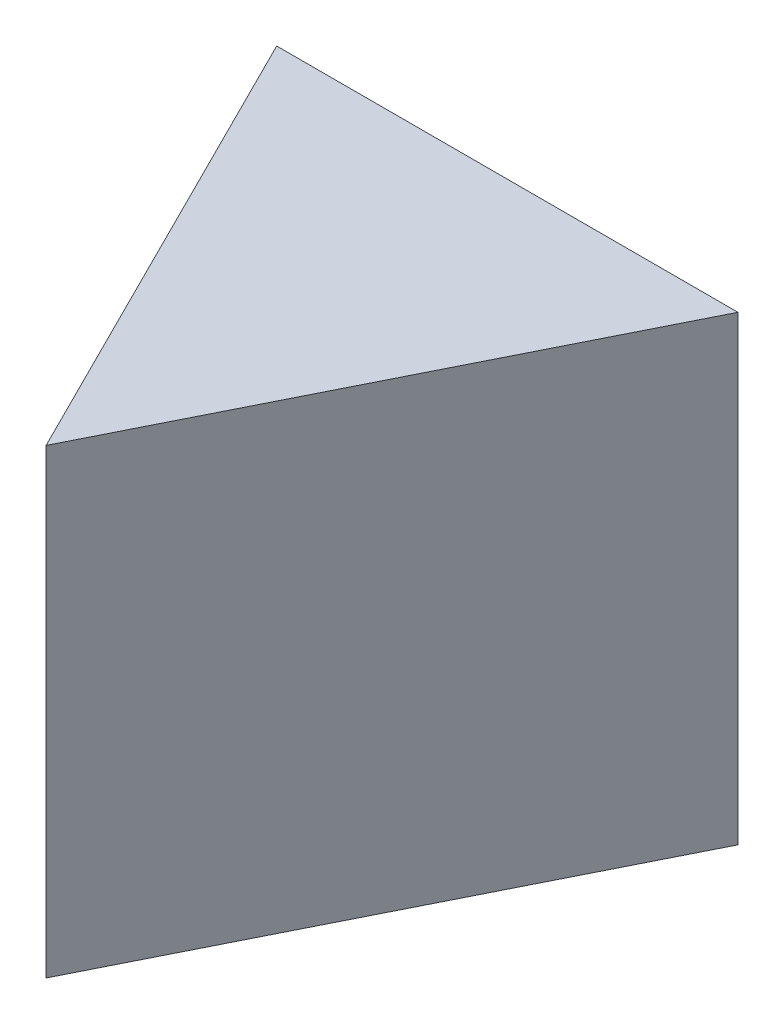
ISO-10303-21;
HEADER;
FILE_DESCRIPTION(('STEP AP214'),'2;1');
FILE_NAME('part.step','',(''),(''),'','','');
FILE_SCHEMA(('AUTOMOTIVE_DESIGN { 1 0 10303 214 1 1 1 1 }'));
ENDSEC;
DATA;
#1=APPLICATION_CONTEXT('core data for automotive mechanical design processes');
#2=APPLICATION_PROTOCOL_DEFINITION('international standard','automotive_design',2000,#1);
#3=PRODUCT_CONTEXT('',#1,'mechanical');
#4=PRODUCT('Part','Part','',(#3));
#5=PRODUCT_RELATED_PRODUCT_CATEGORY('part','',(#4));
#6=PRODUCT_DEFINITION_FORMATION('','',#4);
#7=PRODUCT_DEFINITION_CONTEXT('part definition',#1,'design');
#8=PRODUCT_DEFINITION('design','',#6,#7);
#9=PRODUCT_DEFINITION_SHAPE('','',#8);
#10=(LENGTH_UNIT() NAMED_UNIT(*) SI_UNIT(.MILLI.,.METRE.));
#11=(NAMED_UNIT(*) PLANE_ANGLE_UNIT() SI_UNIT($,.RADIAN.));
#12=(NAMED_UNIT(*) SI_UNIT($,.STERADIAN.) SOLID_ANGLE_UNIT());
#13=UNCERTAINTY_MEASURE_WITH_UNIT(LENGTH_MEASURE(1.E-05),#10,'distance_accuracy_value','');
#14=(GEOMETRIC_REPRESENTATION_CONTEXT(3) GLOBAL_UNCERTAINTY_ASSIGNED_CONTEXT((#13)) GLOBAL_UNIT_ASSIGNED_CONTEXT((#10,
#11,#12)) REPRESENTATION_CONTEXT('',''));
#15=CARTESIAN_POINT('',(0.,0.,0.));
#16=DIRECTION('',(0.,0.,1.));
#17=DIRECTION('',(1.,0.,0.));
#18=AXIS2_PLACEMENT_3D('',#15,#16,#17);
#19=CARTESIAN_POINT('',(0.,0.,20.));
#20=DIRECTION('',(0.,1.,0.));
#21=DIRECTION('',(0.,0.,1.));
#22=AXIS2_PLACEMENT_3D('',#19,#20,#21);
#23=PLANE('',#22);
#24=DIRECTION('',(1.,0.,0.));
#25=VECTOR('',#24,1.);
#26=CARTESIAN_POINT('',(0.,0.,0.));
#27=LINE('',#26,#25);
#28=CARTESIAN_POINT('',(0.,0.,0.));
#29=VERTEX_POINT('',#28);
#30=CARTESIAN_POINT('',(20.,0.,0.));
#31=VERTEX_POINT('',#30);
#32=EDGE_CURVE('E76',#29,#31,#27,.T.);
#33=ORIENTED_EDGE('',*,*,#32,.T.);
#34=DIRECTION('',(-0.447213595499958,0.,0.894427190999916));
#35=VECTOR('',#34,1.);
#36=CARTESIAN_POINT('',(20.,0.,0.));
#37=LINE('',#36,#35);
#38=CARTESIAN_POINT('',(10.,0.,20.));
#39=VERTEX_POINT('',#38);
#40=EDGE_CURVE('E66',#31,#39,#37,.T.);
#41=ORIENTED_EDGE('',*,*,#40,.T.);
#42=DIRECTION('',(-0.447213595499958,0.,-0.894427190999916));
#43=VECTOR('',#42,1.);
#44=CARTESIAN_POINT('',(0.,0.,0.));
#45=LINE('',#44,#43);
#46=EDGE_CURVE('E77',#39,#29,#45,.T.);
#47=ORIENTED_EDGE('',*,*,#46,.T.);
#48=EDGE_LOOP('',(#33,#41,#47));
#49=FACE_BOUND('',#48,.T.);
#50=ADVANCED_FACE('F33',(#49),#23,.F.);
#51=CARTESIAN_POINT('',(0.,20.,20.));
#52=DIRECTION('',(0.,-1.,0.));
#53=DIRECTION('',(0.,0.,-1.));
#54=AXIS2_PLACEMENT_3D('',#51,#52,#53);
#55=PLANE('',#54);
#56=DIRECTION('',(-0.447213595499958,0.,-0.894427190999916));
#57=VECTOR('',#56,1.);
#58=CARTESIAN_POINT('',(0.,20.,0.));
#59=LINE('',#58,#57);
#60=CARTESIAN_POINT('',(10.,20.,20.));
#61=VERTEX_POINT('',#60);
#62=CARTESIAN_POINT('',(0.,20.,0.));
#63=VERTEX_POINT('',#62);
#64=EDGE_CURVE('E47',#61,#63,#59,.T.);
#65=ORIENTED_EDGE('',*,*,#64,.F.);
#66=DIRECTION('',(-0.447213595499958,0.,0.894427190999916));
#67=VECTOR('',#66,1.);
#68=CARTESIAN_POINT('',(20.,20.,0.));
#69=LINE('',#68,#67);
#70=CARTESIAN_POINT('',(20.,20.,0.));
#71=VERTEX_POINT('',#70);
#72=EDGE_CURVE('E73',#71,#61,#69,.T.);
#73=ORIENTED_EDGE('',*,*,#72,.F.);
#74=DIRECTION('',(-1.,0.,0.));
#75=VECTOR('',#74,1.);
#76=CARTESIAN_POINT('',(0.,20.,0.));
#77=LINE('',#76,#75);
#78=EDGE_CURVE('E11',#71,#63,#77,.T.);
#79=ORIENTED_EDGE('',*,*,#78,.T.);
#80=EDGE_LOOP('',(#65,#73,#79));
#81=FACE_BOUND('',#80,.T.);
#82=ADVANCED_FACE('F89',(#81),#55,.F.);
#83=CARTESIAN_POINT('',(0.,0.,0.));
#84=DIRECTION('',(0.,0.,-1.));
#85=DIRECTION('',(-1.,0.,0.));
#86=AXIS2_PLACEMENT_3D('',#83,#84,#85);
#87=PLANE('',#86);
#88=DIRECTION('',(0.,-1.,0.));
#89=VECTOR('',#88,1.);
#90=CARTESIAN_POINT('',(0.,0.,0.));
#91=LINE('',#90,#89);
#92=EDGE_CURVE('E52',#63,#29,#91,.T.);
#93=ORIENTED_EDGE('',*,*,#92,.F.);
#94=ORIENTED_EDGE('',*,*,#78,.F.);
#95=DIRECTION('',(0.,1.,0.));
#96=VECTOR('',#95,1.);
#97=CARTESIAN_POINT('',(20.,0.,0.));
#98=LINE('',#97,#96);
#99=EDGE_CURVE('E40',#31,#71,#98,.T.);
#100=ORIENTED_EDGE('',*,*,#99,.F.);
#101=ORIENTED_EDGE('',*,*,#32,.F.);
#102=EDGE_LOOP('',(#93,#94,#100,#101));
#103=FACE_BOUND('',#102,.T.);
#104=ADVANCED_FACE('F81',(#103),#87,.T.);
#105=CARTESIAN_POINT('',(0.,0.,0.));
#106=DIRECTION('',(0.894427190999916,0.,-0.447213595499958));
#107=DIRECTION('',(-0.447213595499958,0.,-0.894427190999916));
#108=AXIS2_PLACEMENT_3D('',#105,#106,#107);
#109=PLANE('',#108);
#110=ORIENTED_EDGE('',*,*,#64,.T.);
#111=ORIENTED_EDGE('',*,*,#92,.T.);
#112=ORIENTED_EDGE('',*,*,#46,.F.);
#113=DIRECTION('',(0.,1.,0.));
#114=VECTOR('',#113,1.);
#115=CARTESIAN_POINT('',(10.,0.,20.));
#116=LINE('',#115,#114);
#117=EDGE_CURVE('E71',#39,#61,#116,.T.);
#118=ORIENTED_EDGE('',*,*,#117,.T.);
#119=EDGE_LOOP('',(#110,#111,#112,#118));
#120=FACE_BOUND('',#119,.T.);
#121=ADVANCED_FACE('F88',(#120),#109,.F.);
#122=CARTESIAN_POINT('',(20.,0.,0.));
#123=DIRECTION('',(-0.894427190999916,0.,-0.447213595499958));
#124=DIRECTION('',(-0.447213595499958,0.,0.894427190999916));
#125=AXIS2_PLACEMENT_3D('',#122,#123,#124);
#126=PLANE('',#125);
#127=ORIENTED_EDGE('',*,*,#72,.T.);
#128=ORIENTED_EDGE('',*,*,#117,.F.);
#129=ORIENTED_EDGE('',*,*,#40,.F.);
#130=ORIENTED_EDGE('',*,*,#99,.T.);
#131=EDGE_LOOP('',(#127,#128,#129,#130));
#132=FACE_BOUND('',#131,.T.);
#133=ADVANCED_FACE('F68',(#132),#126,.F.);
#134=CLOSED_SHELL('',(#50,#82,#104,#121,#133));
#135=MANIFOLD_SOLID_BREP('B2',#134);
#136=ADVANCED_BREP_SHAPE_REPRESENTATION('',(#18,#135),#14);
#137=SHAPE_DEFINITION_REPRESENTATION(#9,#136);
ENDSEC;
END-ISO-10303-21;
